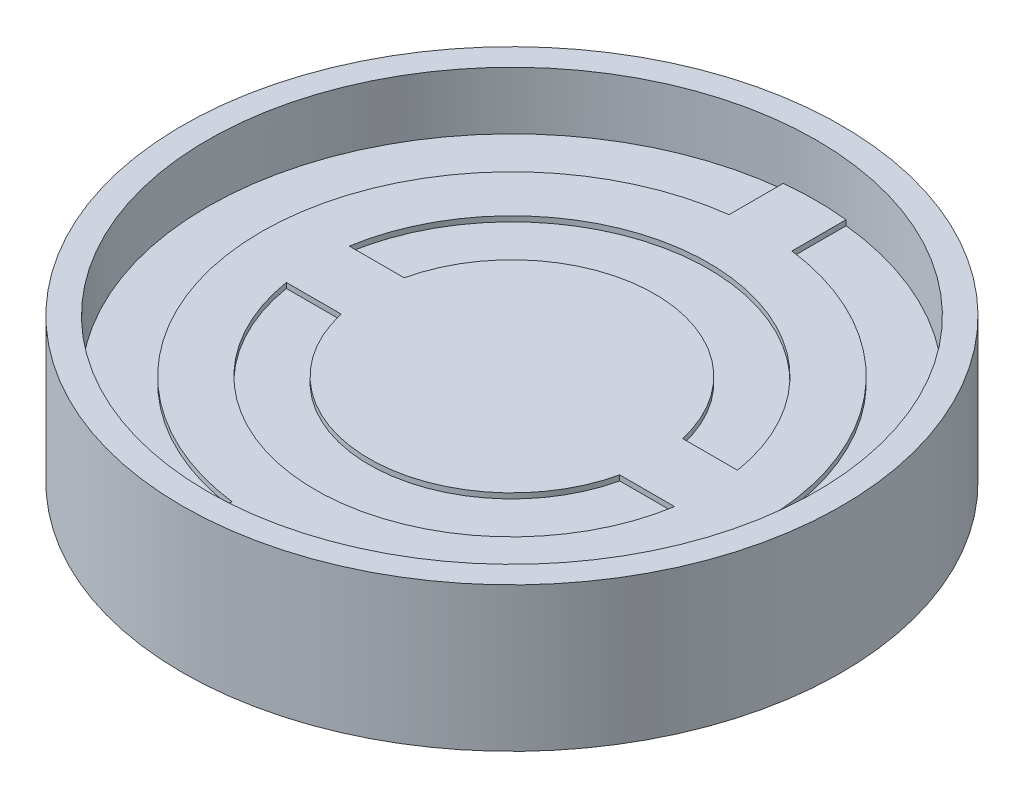
ISO-10303-21;
HEADER;
FILE_DESCRIPTION(('STEP AP214'),'2;1');
FILE_NAME('part.step','',(''),(''),'','','');
FILE_SCHEMA(('AUTOMOTIVE_DESIGN { 1 0 10303 214 1 1 1 1 }'));
ENDSEC;
DATA;
#1=APPLICATION_CONTEXT('core data for automotive mechanical design processes');
#2=APPLICATION_PROTOCOL_DEFINITION('international standard','automotive_design',2000,#1);
#3=PRODUCT_CONTEXT('',#1,'mechanical');
#4=PRODUCT('Part','Part','',(#3));
#5=PRODUCT_RELATED_PRODUCT_CATEGORY('part','',(#4));
#6=PRODUCT_DEFINITION_FORMATION('','',#4);
#7=PRODUCT_DEFINITION_CONTEXT('part definition',#1,'design');
#8=PRODUCT_DEFINITION('design','',#6,#7);
#9=PRODUCT_DEFINITION_SHAPE('','',#8);
#10=(LENGTH_UNIT() NAMED_UNIT(*) SI_UNIT(.MILLI.,.METRE.));
#11=(NAMED_UNIT(*) PLANE_ANGLE_UNIT() SI_UNIT($,.RADIAN.));
#12=(NAMED_UNIT(*) SI_UNIT($,.STERADIAN.) SOLID_ANGLE_UNIT());
#13=UNCERTAINTY_MEASURE_WITH_UNIT(LENGTH_MEASURE(1.E-05),#10,'distance_accuracy_value','');
#14=(GEOMETRIC_REPRESENTATION_CONTEXT(3) GLOBAL_UNCERTAINTY_ASSIGNED_CONTEXT((#13)) GLOBAL_UNIT_ASSIGNED_CONTEXT((#10,
#11,#12)) REPRESENTATION_CONTEXT('',''));
#15=CARTESIAN_POINT('',(0.,0.,0.));
#16=DIRECTION('',(0.,0.,1.));
#17=DIRECTION('',(1.,0.,0.));
#18=AXIS2_PLACEMENT_3D('',#15,#16,#17);
#19=CARTESIAN_POINT('',(0.,-0.6985,0.));
#20=DIRECTION('',(0.,-1.,0.));
#21=DIRECTION('',(0.,0.,1.));
#22=AXIS2_PLACEMENT_3D('',#19,#20,#21);
#23=PLANE('',#22);
#24=CARTESIAN_POINT('',(0.,-0.6985,0.));
#25=DIRECTION('',(0.,1.,0.));
#26=DIRECTION('',(0.,0.,1.));
#27=AXIS2_PLACEMENT_3D('',#24,#25,#26);
#28=CIRCLE('',#27,12.13485);
#29=CARTESIAN_POINT('',(1.524,-0.6985,12.0387710553237));
#30=VERTEX_POINT('',#29);
#31=CARTESIAN_POINT('',(1.524,-0.6985,-12.0387710553237));
#32=VERTEX_POINT('',#31);
#33=EDGE_CURVE('E324',#30,#32,#28,.T.);
#34=ORIENTED_EDGE('',*,*,#33,.T.);
#35=DIRECTION('',(0.,0.,1.));
#36=VECTOR('',#35,1.);
#37=CARTESIAN_POINT('',(1.524,-0.6985,0.));
#38=LINE('',#37,#36);
#39=CARTESIAN_POINT('',(1.524,-0.6985,-14.6657288291445));
#40=VERTEX_POINT('',#39);
#41=EDGE_CURVE('E321',#40,#32,#38,.T.);
#42=ORIENTED_EDGE('',*,*,#41,.F.);
#43=CARTESIAN_POINT('',(0.,-0.6985,0.));
#44=DIRECTION('',(0.,1.,0.));
#45=DIRECTION('',(0.,0.,1.));
#46=AXIS2_PLACEMENT_3D('',#43,#44,#45);
#47=CIRCLE('',#46,14.7447);
#48=CARTESIAN_POINT('',(1.524,-0.6985,14.6657288291445));
#49=VERTEX_POINT('',#48);
#50=EDGE_CURVE('E368',#49,#40,#47,.T.);
#51=ORIENTED_EDGE('',*,*,#50,.F.);
#52=DIRECTION('',(0.,0.,-1.));
#53=VECTOR('',#52,1.);
#54=CARTESIAN_POINT('',(1.524,-0.6985,0.));
#55=LINE('',#54,#53);
#56=EDGE_CURVE('E326',#49,#30,#55,.T.);
#57=ORIENTED_EDGE('',*,*,#56,.T.);
#58=EDGE_LOOP('',(#34,#42,#51,#57));
#59=FACE_BOUND('',#58,.T.);
#60=ADVANCED_FACE('F36',(#59),#23,.T.);
#61=CARTESIAN_POINT('',(0.,0.6985,0.));
#62=DIRECTION('',(0.,1.,0.));
#63=DIRECTION('',(0.,0.,1.));
#64=AXIS2_PLACEMENT_3D('',#61,#62,#63);
#65=CYLINDRICAL_SURFACE('',#64,14.7447);
#66=CARTESIAN_POINT('',(0.,3.4925,0.));
#67=DIRECTION('',(0.,1.,0.));
#68=DIRECTION('',(0.,0.,1.));
#69=AXIS2_PLACEMENT_3D('',#66,#67,#68);
#70=CIRCLE('',#69,14.7447);
#71=CARTESIAN_POINT('',(0.,3.4925,14.7447));
#72=VERTEX_POINT('',#71);
#73=EDGE_CURVE('E472',#72,#72,#70,.T.);
#74=ORIENTED_EDGE('',*,*,#73,.T.);
#75=EDGE_LOOP('',(#74));
#76=FACE_BOUND('',#75,.T.);
#77=DIRECTION('',(0.,-1.,0.));
#78=VECTOR('',#77,1.);
#79=CARTESIAN_POINT('',(-1.524,0.9525,-14.6657288291445));
#80=LINE('',#79,#78);
#81=CARTESIAN_POINT('',(-1.524,0.9525,-14.6657288291445));
#82=VERTEX_POINT('',#81);
#83=CARTESIAN_POINT('',(-1.524,0.6985,-14.6657288291445));
#84=VERTEX_POINT('',#83);
#85=EDGE_CURVE('E448',#82,#84,#80,.T.);
#86=ORIENTED_EDGE('',*,*,#85,.F.);
#87=CARTESIAN_POINT('',(0.,0.9525,0.));
#88=DIRECTION('',(0.,1.,0.));
#89=DIRECTION('',(0.,0.,1.));
#90=AXIS2_PLACEMENT_3D('',#87,#88,#89);
#91=CIRCLE('',#90,14.7447);
#92=CARTESIAN_POINT('',(1.524,0.9525,-14.6657288291445));
#93=VERTEX_POINT('',#92);
#94=EDGE_CURVE('E413',#93,#82,#91,.T.);
#95=ORIENTED_EDGE('',*,*,#94,.F.);
#96=DIRECTION('',(0.,-1.,0.));
#97=VECTOR('',#96,1.);
#98=CARTESIAN_POINT('',(1.524,0.9525,-14.6657288291445));
#99=LINE('',#98,#97);
#100=CARTESIAN_POINT('',(1.524,0.6985,-14.6657288291445));
#101=VERTEX_POINT('',#100);
#102=EDGE_CURVE('E451',#93,#101,#99,.T.);
#103=ORIENTED_EDGE('',*,*,#102,.T.);
#104=CARTESIAN_POINT('',(0.,0.6985,0.));
#105=DIRECTION('',(0.,1.,0.));
#106=DIRECTION('',(0.,0.,1.));
#107=AXIS2_PLACEMENT_3D('',#104,#105,#106);
#108=CIRCLE('',#107,14.7447);
#109=CARTESIAN_POINT('',(1.524,0.6985,14.6657288291445));
#110=VERTEX_POINT('',#109);
#111=EDGE_CURVE('E493',#110,#101,#108,.T.);
#112=ORIENTED_EDGE('',*,*,#111,.F.);
#113=DIRECTION('',(0.,-1.,0.));
#114=VECTOR('',#113,1.);
#115=CARTESIAN_POINT('',(1.524,0.9525,14.6657288291445));
#116=LINE('',#115,#114);
#117=CARTESIAN_POINT('',(1.524,0.9525,14.6657288291445));
#118=VERTEX_POINT('',#117);
#119=EDGE_CURVE('E461',#118,#110,#116,.T.);
#120=ORIENTED_EDGE('',*,*,#119,.F.);
#121=CARTESIAN_POINT('',(0.,0.9525,0.));
#122=DIRECTION('',(0.,1.,0.));
#123=DIRECTION('',(0.,0.,1.));
#124=AXIS2_PLACEMENT_3D('',#121,#122,#123);
#125=CIRCLE('',#124,14.7447);
#126=CARTESIAN_POINT('',(-1.524,0.9525,14.6657288291445));
#127=VERTEX_POINT('',#126);
#128=EDGE_CURVE('E405',#127,#118,#125,.T.);
#129=ORIENTED_EDGE('',*,*,#128,.F.);
#130=DIRECTION('',(0.,-1.,0.));
#131=VECTOR('',#130,1.);
#132=CARTESIAN_POINT('',(-1.524,0.9525,14.6657288291445));
#133=LINE('',#132,#131);
#134=CARTESIAN_POINT('',(-1.524,0.6985,14.6657288291445));
#135=VERTEX_POINT('',#134);
#136=EDGE_CURVE('E464',#127,#135,#133,.T.);
#137=ORIENTED_EDGE('',*,*,#136,.T.);
#138=EDGE_CURVE('E495',#84,#135,#108,.T.);
#139=ORIENTED_EDGE('',*,*,#138,.F.);
#140=EDGE_LOOP('',(#86,#95,#103,#112,#120,#129,#137,#139));
#141=FACE_BOUND('',#140,.T.);
#142=ADVANCED_FACE('F516',(#76,#141),#65,.F.);
#143=CARTESIAN_POINT('',(0.,0.6985,0.));
#144=DIRECTION('',(0.,1.,0.));
#145=DIRECTION('',(0.,0.,1.));
#146=AXIS2_PLACEMENT_3D('',#143,#144,#145);
#147=PLANE('',#146);
#148=CARTESIAN_POINT('',(0.,0.6985,0.));
#149=DIRECTION('',(0.,1.,0.));
#150=DIRECTION('',(0.,0.,1.));
#151=AXIS2_PLACEMENT_3D('',#148,#149,#150);
#152=CIRCLE('',#151,12.13485);
#153=CARTESIAN_POINT('',(-1.524,0.6985,-12.0387710553237));
#154=VERTEX_POINT('',#153);
#155=CARTESIAN_POINT('',(-1.524,0.6985,12.0387710553237));
#156=VERTEX_POINT('',#155);
#157=EDGE_CURVE('E438',#154,#156,#152,.T.);
#158=ORIENTED_EDGE('',*,*,#157,.F.);
#159=DIRECTION('',(0.,0.,1.));
#160=VECTOR('',#159,1.);
#161=CARTESIAN_POINT('',(-1.524,0.6985,0.));
#162=LINE('',#161,#160);
#163=EDGE_CURVE('E435',#84,#154,#162,.T.);
#164=ORIENTED_EDGE('',*,*,#163,.F.);
#165=ORIENTED_EDGE('',*,*,#138,.T.);
#166=DIRECTION('',(0.,0.,-1.));
#167=VECTOR('',#166,1.);
#168=CARTESIAN_POINT('',(-1.524,0.6985,0.));
#169=LINE('',#168,#167);
#170=EDGE_CURVE('E441',#135,#156,#169,.T.);
#171=ORIENTED_EDGE('',*,*,#170,.T.);
#172=EDGE_LOOP('',(#158,#164,#165,#171));
#173=FACE_BOUND('',#172,.T.);
#174=ADVANCED_FACE('F503',(#173),#147,.T.);
#175=CARTESIAN_POINT('',(1.524,0.6985,12.0387710553237));
#176=VERTEX_POINT('',#175);
#177=CARTESIAN_POINT('',(1.524,0.6985,-12.0387710553237));
#178=VERTEX_POINT('',#177);
#179=EDGE_CURVE('E442',#176,#178,#152,.T.);
#180=ORIENTED_EDGE('',*,*,#179,.F.);
#181=DIRECTION('',(0.,0.,-1.));
#182=VECTOR('',#181,1.);
#183=CARTESIAN_POINT('',(1.524,0.6985,0.));
#184=LINE('',#183,#182);
#185=EDGE_CURVE('E444',#110,#176,#184,.T.);
#186=ORIENTED_EDGE('',*,*,#185,.F.);
#187=ORIENTED_EDGE('',*,*,#111,.T.);
#188=DIRECTION('',(0.,0.,1.));
#189=VECTOR('',#188,1.);
#190=CARTESIAN_POINT('',(1.524,0.6985,0.));
#191=LINE('',#190,#189);
#192=EDGE_CURVE('E378',#101,#178,#191,.T.);
#193=ORIENTED_EDGE('',*,*,#192,.T.);
#194=EDGE_LOOP('',(#180,#186,#187,#193));
#195=FACE_BOUND('',#194,.T.);
#196=ADVANCED_FACE('F535',(#195),#147,.T.);
#197=CARTESIAN_POINT('',(0.,3.4925,0.));
#198=DIRECTION('',(0.,-1.,0.));
#199=DIRECTION('',(0.,0.,-1.));
#200=AXIS2_PLACEMENT_3D('',#197,#198,#199);
#201=CYLINDRICAL_SURFACE('',#200,15.9639);
#202=CARTESIAN_POINT('',(0.,3.4925,0.));
#203=DIRECTION('',(0.,1.,0.));
#204=DIRECTION('',(0.,0.,1.));
#205=AXIS2_PLACEMENT_3D('',#202,#203,#204);
#206=CIRCLE('',#205,15.9639);
#207=CARTESIAN_POINT('',(0.,3.4925,15.9639));
#208=VERTEX_POINT('',#207);
#209=EDGE_CURVE('E11',#208,#208,#206,.T.);
#210=ORIENTED_EDGE('',*,*,#209,.F.);
#211=EDGE_LOOP('',(#210));
#212=FACE_BOUND('',#211,.T.);
#213=CARTESIAN_POINT('',(0.,-3.4925,0.));
#214=DIRECTION('',(0.,1.,0.));
#215=DIRECTION('',(0.,0.,1.));
#216=AXIS2_PLACEMENT_3D('',#213,#214,#215);
#217=CIRCLE('',#216,15.9639);
#218=CARTESIAN_POINT('',(0.,-3.4925,15.9639));
#219=VERTEX_POINT('',#218);
#220=EDGE_CURVE('E40',#219,#219,#217,.T.);
#221=ORIENTED_EDGE('',*,*,#220,.T.);
#222=EDGE_LOOP('',(#221));
#223=FACE_BOUND('',#222,.T.);
#224=ADVANCED_FACE('F38',(#212,#223),#201,.T.);
#225=CARTESIAN_POINT('',(0.,3.4925,0.));
#226=DIRECTION('',(0.,1.,0.));
#227=DIRECTION('',(0.,0.,1.));
#228=AXIS2_PLACEMENT_3D('',#225,#226,#227);
#229=PLANE('',#228);
#230=ORIENTED_EDGE('',*,*,#73,.F.);
#231=EDGE_LOOP('',(#230));
#232=FACE_BOUND('',#231,.T.);
#233=ORIENTED_EDGE('',*,*,#209,.T.);
#234=EDGE_LOOP('',(#233));
#235=FACE_BOUND('',#234,.T.);
#236=ADVANCED_FACE('F543',(#232,#235),#229,.T.);
#237=CARTESIAN_POINT('',(0.,-3.4925,0.));
#238=DIRECTION('',(0.,1.,0.));
#239=DIRECTION('',(0.,0.,1.));
#240=AXIS2_PLACEMENT_3D('',#237,#238,#239);
#241=PLANE('',#240);
#242=CARTESIAN_POINT('',(0.,-3.4925,0.));
#243=DIRECTION('',(0.,1.,0.));
#244=DIRECTION('',(0.,0.,1.));
#245=AXIS2_PLACEMENT_3D('',#242,#243,#244);
#246=CIRCLE('',#245,14.7447);
#247=CARTESIAN_POINT('',(0.,-3.4925,14.7447));
#248=VERTEX_POINT('',#247);
#249=EDGE_CURVE('E352',#248,#248,#246,.T.);
#250=ORIENTED_EDGE('',*,*,#249,.T.);
#251=EDGE_LOOP('',(#250));
#252=FACE_BOUND('',#251,.T.);
#253=ORIENTED_EDGE('',*,*,#220,.F.);
#254=EDGE_LOOP('',(#253));
#255=FACE_BOUND('',#254,.T.);
#256=ADVANCED_FACE('F772',(#252,#255),#241,.F.);
#257=CARTESIAN_POINT('',(-1.524,0.9525,0.));
#258=DIRECTION('',(1.,0.,0.));
#259=DIRECTION('',(0.,0.,-1.));
#260=AXIS2_PLACEMENT_3D('',#257,#258,#259);
#261=PLANE('',#260);
#262=ORIENTED_EDGE('',*,*,#163,.T.);
#263=DIRECTION('',(0.,-1.,0.));
#264=VECTOR('',#263,1.);
#265=CARTESIAN_POINT('',(-1.524,0.9525,-12.0387710553237));
#266=LINE('',#265,#264);
#267=CARTESIAN_POINT('',(-1.524,0.9525,-12.0387710553237));
#268=VERTEX_POINT('',#267);
#269=EDGE_CURVE('E469',#268,#154,#266,.T.);
#270=ORIENTED_EDGE('',*,*,#269,.F.);
#271=DIRECTION('',(0.,0.,1.));
#272=VECTOR('',#271,1.);
#273=CARTESIAN_POINT('',(-1.524,0.9525,0.));
#274=LINE('',#273,#272);
#275=EDGE_CURVE('E396',#82,#268,#274,.T.);
#276=ORIENTED_EDGE('',*,*,#275,.F.);
#277=ORIENTED_EDGE('',*,*,#85,.T.);
#278=EDGE_LOOP('',(#262,#270,#276,#277));
#279=FACE_BOUND('',#278,.T.);
#280=ADVANCED_FACE('F515',(#279),#261,.F.);
#281=CARTESIAN_POINT('',(0.,0.9525,0.));
#282=DIRECTION('',(0.,-1.,0.));
#283=DIRECTION('',(0.,0.,-1.));
#284=AXIS2_PLACEMENT_3D('',#281,#282,#283);
#285=CYLINDRICAL_SURFACE('',#284,12.13485);
#286=ORIENTED_EDGE('',*,*,#157,.T.);
#287=DIRECTION('',(0.,-1.,0.));
#288=VECTOR('',#287,1.);
#289=CARTESIAN_POINT('',(-1.524,0.9525,12.0387710553237));
#290=LINE('',#289,#288);
#291=CARTESIAN_POINT('',(-1.524,0.9525,12.0387710553237));
#292=VERTEX_POINT('',#291);
#293=EDGE_CURVE('E466',#292,#156,#290,.T.);
#294=ORIENTED_EDGE('',*,*,#293,.F.);
#295=CARTESIAN_POINT('',(0.,0.9525,0.));
#296=DIRECTION('',(0.,1.,0.));
#297=DIRECTION('',(0.,0.,1.));
#298=AXIS2_PLACEMENT_3D('',#295,#296,#297);
#299=CIRCLE('',#298,12.13485);
#300=EDGE_CURVE('E399',#268,#292,#299,.T.);
#301=ORIENTED_EDGE('',*,*,#300,.F.);
#302=ORIENTED_EDGE('',*,*,#269,.T.);
#303=EDGE_LOOP('',(#286,#294,#301,#302));
#304=FACE_BOUND('',#303,.T.);
#305=ADVANCED_FACE('F511',(#304),#285,.T.);
#306=CARTESIAN_POINT('',(-1.524,0.9525,0.));
#307=DIRECTION('',(-1.,0.,0.));
#308=DIRECTION('',(0.,0.,1.));
#309=AXIS2_PLACEMENT_3D('',#306,#307,#308);
#310=PLANE('',#309);
#311=ORIENTED_EDGE('',*,*,#170,.F.);
#312=ORIENTED_EDGE('',*,*,#136,.F.);
#313=DIRECTION('',(0.,0.,-1.));
#314=VECTOR('',#313,1.);
#315=CARTESIAN_POINT('',(-1.524,0.9525,0.));
#316=LINE('',#315,#314);
#317=EDGE_CURVE('E401',#127,#292,#316,.T.);
#318=ORIENTED_EDGE('',*,*,#317,.T.);
#319=ORIENTED_EDGE('',*,*,#293,.T.);
#320=EDGE_LOOP('',(#311,#312,#318,#319));
#321=FACE_BOUND('',#320,.T.);
#322=ADVANCED_FACE('F507',(#321),#310,.T.);
#323=CARTESIAN_POINT('',(1.524,0.9525,0.));
#324=DIRECTION('',(-1.,0.,0.));
#325=DIRECTION('',(0.,0.,1.));
#326=AXIS2_PLACEMENT_3D('',#323,#324,#325);
#327=PLANE('',#326);
#328=ORIENTED_EDGE('',*,*,#185,.T.);
#329=DIRECTION('',(0.,-1.,0.));
#330=VECTOR('',#329,1.);
#331=CARTESIAN_POINT('',(1.524,0.9525,12.0387710553237));
#332=LINE('',#331,#330);
#333=CARTESIAN_POINT('',(1.524,0.9525,12.0387710553237));
#334=VERTEX_POINT('',#333);
#335=EDGE_CURVE('E458',#334,#176,#332,.T.);
#336=ORIENTED_EDGE('',*,*,#335,.F.);
#337=DIRECTION('',(0.,0.,-1.));
#338=VECTOR('',#337,1.);
#339=CARTESIAN_POINT('',(1.524,0.9525,0.));
#340=LINE('',#339,#338);
#341=EDGE_CURVE('E408',#118,#334,#340,.T.);
#342=ORIENTED_EDGE('',*,*,#341,.F.);
#343=ORIENTED_EDGE('',*,*,#119,.T.);
#344=EDGE_LOOP('',(#328,#336,#342,#343));
#345=FACE_BOUND('',#344,.T.);
#346=ADVANCED_FACE('F531',(#345),#327,.F.);
#347=ORIENTED_EDGE('',*,*,#179,.T.);
#348=DIRECTION('',(0.,-1.,0.));
#349=VECTOR('',#348,1.);
#350=CARTESIAN_POINT('',(1.524,0.9525,-12.0387710553237));
#351=LINE('',#350,#349);
#352=CARTESIAN_POINT('',(1.524,0.9525,-12.0387710553237));
#353=VERTEX_POINT('',#352);
#354=EDGE_CURVE('E455',#353,#178,#351,.T.);
#355=ORIENTED_EDGE('',*,*,#354,.F.);
#356=EDGE_CURVE('E402',#334,#353,#299,.T.);
#357=ORIENTED_EDGE('',*,*,#356,.F.);
#358=ORIENTED_EDGE('',*,*,#335,.T.);
#359=EDGE_LOOP('',(#347,#355,#357,#358));
#360=FACE_BOUND('',#359,.T.);
#361=ADVANCED_FACE('F534',(#360),#285,.T.);
#362=CARTESIAN_POINT('',(1.524,0.9525,0.));
#363=DIRECTION('',(1.,0.,0.));
#364=DIRECTION('',(0.,0.,-1.));
#365=AXIS2_PLACEMENT_3D('',#362,#363,#364);
#366=PLANE('',#365);
#367=ORIENTED_EDGE('',*,*,#192,.F.);
#368=ORIENTED_EDGE('',*,*,#102,.F.);
#369=DIRECTION('',(0.,0.,1.));
#370=VECTOR('',#369,1.);
#371=CARTESIAN_POINT('',(1.524,0.9525,0.));
#372=LINE('',#371,#370);
#373=EDGE_CURVE('E410',#93,#353,#372,.T.);
#374=ORIENTED_EDGE('',*,*,#373,.T.);
#375=ORIENTED_EDGE('',*,*,#354,.T.);
#376=EDGE_LOOP('',(#367,#368,#374,#375));
#377=FACE_BOUND('',#376,.T.);
#378=ADVANCED_FACE('F525',(#377),#366,.T.);
#379=CARTESIAN_POINT('',(0.,0.9525,0.));
#380=DIRECTION('',(0.,-1.,0.));
#381=DIRECTION('',(0.,0.,-1.));
#382=AXIS2_PLACEMENT_3D('',#379,#380,#381);
#383=CYLINDRICAL_SURFACE('',#382,9.525);
#384=CARTESIAN_POINT('',(0.,0.6985,0.));
#385=DIRECTION('',(0.,1.,0.));
#386=DIRECTION('',(0.,0.,1.));
#387=AXIS2_PLACEMENT_3D('',#384,#385,#386);
#388=CIRCLE('',#387,9.525);
#389=CARTESIAN_POINT('',(9.40228956159084,0.6985,-1.524));
#390=VERTEX_POINT('',#389);
#391=CARTESIAN_POINT('',(-9.40228956159084,0.6985,-1.524));
#392=VERTEX_POINT('',#391);
#393=EDGE_CURVE('E428',#390,#392,#388,.T.);
#394=ORIENTED_EDGE('',*,*,#393,.F.);
#395=DIRECTION('',(0.,-1.,0.));
#396=VECTOR('',#395,1.);
#397=CARTESIAN_POINT('',(9.40228956159084,0.9525,-1.524));
#398=LINE('',#397,#396);
#399=CARTESIAN_POINT('',(9.40228956159084,0.9525,-1.524));
#400=VERTEX_POINT('',#399);
#401=EDGE_CURVE('E452',#400,#390,#398,.T.);
#402=ORIENTED_EDGE('',*,*,#401,.F.);
#403=CARTESIAN_POINT('',(0.,0.9525,0.));
#404=DIRECTION('',(0.,1.,0.));
#405=DIRECTION('',(0.,0.,1.));
#406=AXIS2_PLACEMENT_3D('',#403,#404,#405);
#407=CIRCLE('',#406,9.525);
#408=CARTESIAN_POINT('',(-9.40228956159084,0.9525,-1.524));
#409=VERTEX_POINT('',#408);
#410=EDGE_CURVE('E387',#400,#409,#407,.T.);
#411=ORIENTED_EDGE('',*,*,#410,.T.);
#412=DIRECTION('',(0.,-1.,0.));
#413=VECTOR('',#412,1.);
#414=CARTESIAN_POINT('',(-9.40228956159084,0.9525,-1.524));
#415=LINE('',#414,#413);
#416=EDGE_CURVE('E473',#409,#392,#415,.T.);
#417=ORIENTED_EDGE('',*,*,#416,.T.);
#418=EDGE_LOOP('',(#394,#402,#411,#417));
#419=FACE_BOUND('',#418,.T.);
#420=ADVANCED_FACE('F818',(#419),#383,.F.);
#421=CARTESIAN_POINT('',(0.,0.9525,-1.524));
#422=DIRECTION('',(0.,0.,1.));
#423=DIRECTION('',(1.,0.,0.));
#424=AXIS2_PLACEMENT_3D('',#421,#422,#423);
#425=PLANE('',#424);
#426=DIRECTION('',(-1.,0.,0.));
#427=VECTOR('',#426,1.);
#428=CARTESIAN_POINT('',(0.,0.6985,-1.524));
#429=LINE('',#428,#427);
#430=CARTESIAN_POINT('',(6.7451259085728,0.6985,-1.524));
#431=VERTEX_POINT('',#430);
#432=EDGE_CURVE('E430',#390,#431,#429,.T.);
#433=ORIENTED_EDGE('',*,*,#432,.T.);
#434=DIRECTION('',(0.,-1.,0.));
#435=VECTOR('',#434,1.);
#436=CARTESIAN_POINT('',(6.7451259085728,0.9525,-1.524));
#437=LINE('',#436,#435);
#438=CARTESIAN_POINT('',(6.7451259085728,0.9525,-1.524));
#439=VERTEX_POINT('',#438);
#440=EDGE_CURVE('E480',#439,#431,#437,.T.);
#441=ORIENTED_EDGE('',*,*,#440,.F.);
#442=DIRECTION('',(-1.,0.,0.));
#443=VECTOR('',#442,1.);
#444=CARTESIAN_POINT('',(0.,0.9525,-1.524));
#445=LINE('',#444,#443);
#446=EDGE_CURVE('E390',#400,#439,#445,.T.);
#447=ORIENTED_EDGE('',*,*,#446,.F.);
#448=ORIENTED_EDGE('',*,*,#401,.T.);
#449=EDGE_LOOP('',(#433,#441,#447,#448));
#450=FACE_BOUND('',#449,.T.);
#451=ADVANCED_FACE('F825',(#450),#425,.F.);
#452=CARTESIAN_POINT('',(0.,0.9525,0.));
#453=DIRECTION('',(0.,-1.,0.));
#454=DIRECTION('',(0.,0.,-1.));
#455=AXIS2_PLACEMENT_3D('',#452,#453,#454);
#456=CYLINDRICAL_SURFACE('',#455,6.91515);
#457=CARTESIAN_POINT('',(0.,0.6985,0.));
#458=DIRECTION('',(0.,1.,0.));
#459=DIRECTION('',(0.,0.,1.));
#460=AXIS2_PLACEMENT_3D('',#457,#458,#459);
#461=CIRCLE('',#460,6.91515);
#462=CARTESIAN_POINT('',(-6.7451259085728,0.6985,-1.524));
#463=VERTEX_POINT('',#462);
#464=EDGE_CURVE('E420',#431,#463,#461,.T.);
#465=ORIENTED_EDGE('',*,*,#464,.T.);
#466=DIRECTION('',(0.,-1.,0.));
#467=VECTOR('',#466,1.);
#468=CARTESIAN_POINT('',(-6.7451259085728,0.9525,-1.524));
#469=LINE('',#468,#467);
#470=CARTESIAN_POINT('',(-6.7451259085728,0.9525,-1.524));
#471=VERTEX_POINT('',#470);
#472=EDGE_CURVE('E476',#471,#463,#469,.T.);
#473=ORIENTED_EDGE('',*,*,#472,.F.);
#474=CARTESIAN_POINT('',(0.,0.9525,0.));
#475=DIRECTION('',(0.,1.,0.));
#476=DIRECTION('',(0.,0.,1.));
#477=AXIS2_PLACEMENT_3D('',#474,#475,#476);
#478=CIRCLE('',#477,6.91515);
#479=EDGE_CURVE('E379',#439,#471,#478,.T.);
#480=ORIENTED_EDGE('',*,*,#479,.F.);
#481=ORIENTED_EDGE('',*,*,#440,.T.);
#482=EDGE_LOOP('',(#465,#473,#480,#481));
#483=FACE_BOUND('',#482,.T.);
#484=ADVANCED_FACE('F833',(#483),#456,.T.);
#485=CARTESIAN_POINT('',(-6.7451259085728,0.6985,1.524));
#486=VERTEX_POINT('',#485);
#487=CARTESIAN_POINT('',(6.7451259085728,0.6985,1.524));
#488=VERTEX_POINT('',#487);
#489=EDGE_CURVE('E371',#486,#488,#461,.T.);
#490=ORIENTED_EDGE('',*,*,#489,.T.);
#491=DIRECTION('',(0.,-1.,0.));
#492=VECTOR('',#491,1.);
#493=CARTESIAN_POINT('',(6.7451259085728,0.9525,1.524));
#494=LINE('',#493,#492);
#495=CARTESIAN_POINT('',(6.7451259085728,0.9525,1.524));
#496=VERTEX_POINT('',#495);
#497=EDGE_CURVE('E477',#496,#488,#494,.T.);
#498=ORIENTED_EDGE('',*,*,#497,.F.);
#499=CARTESIAN_POINT('',(-6.7451259085728,0.9525,1.524));
#500=VERTEX_POINT('',#499);
#501=EDGE_CURVE('E375',#500,#496,#478,.T.);
#502=ORIENTED_EDGE('',*,*,#501,.F.);
#503=DIRECTION('',(0.,-1.,0.));
#504=VECTOR('',#503,1.);
#505=CARTESIAN_POINT('',(-6.7451259085728,0.9525,1.524));
#506=LINE('',#505,#504);
#507=EDGE_CURVE('E416',#500,#486,#506,.T.);
#508=ORIENTED_EDGE('',*,*,#507,.T.);
#509=EDGE_LOOP('',(#490,#498,#502,#508));
#510=FACE_BOUND('',#509,.T.);
#511=ADVANCED_FACE('F841',(#510),#456,.T.);
#512=CARTESIAN_POINT('',(0.,0.9525,1.524));
#513=DIRECTION('',(0.,0.,1.));
#514=DIRECTION('',(1.,0.,0.));
#515=AXIS2_PLACEMENT_3D('',#512,#513,#514);
#516=PLANE('',#515);
#517=DIRECTION('',(-1.,0.,0.));
#518=VECTOR('',#517,1.);
#519=CARTESIAN_POINT('',(0.,0.6985,1.524));
#520=LINE('',#519,#518);
#521=CARTESIAN_POINT('',(9.40228956159084,0.6985,1.524));
#522=VERTEX_POINT('',#521);
#523=EDGE_CURVE('E419',#522,#488,#520,.T.);
#524=ORIENTED_EDGE('',*,*,#523,.F.);
#525=DIRECTION('',(0.,-1.,0.));
#526=VECTOR('',#525,1.);
#527=CARTESIAN_POINT('',(9.40228956159084,0.9525,1.524));
#528=LINE('',#527,#526);
#529=CARTESIAN_POINT('',(9.40228956159084,0.9525,1.524));
#530=VERTEX_POINT('',#529);
#531=EDGE_CURVE('E490',#530,#522,#528,.T.);
#532=ORIENTED_EDGE('',*,*,#531,.F.);
#533=DIRECTION('',(-1.,0.,0.));
#534=VECTOR('',#533,1.);
#535=CARTESIAN_POINT('',(0.,0.9525,1.524));
#536=LINE('',#535,#534);
#537=EDGE_CURVE('E377',#530,#496,#536,.T.);
#538=ORIENTED_EDGE('',*,*,#537,.T.);
#539=ORIENTED_EDGE('',*,*,#497,.T.);
#540=EDGE_LOOP('',(#524,#532,#538,#539));
#541=FACE_BOUND('',#540,.T.);
#542=ADVANCED_FACE('F849',(#541),#516,.T.);
#543=CARTESIAN_POINT('',(0.,0.9525,0.));
#544=DIRECTION('',(0.,-1.,0.));
#545=DIRECTION('',(0.,0.,-1.));
#546=AXIS2_PLACEMENT_3D('',#543,#544,#545);
#547=CYLINDRICAL_SURFACE('',#546,9.525);
#548=CARTESIAN_POINT('',(0.,0.6985,0.));
#549=DIRECTION('',(0.,1.,0.));
#550=DIRECTION('',(0.,0.,1.));
#551=AXIS2_PLACEMENT_3D('',#548,#549,#550);
#552=CIRCLE('',#551,9.525);
#553=CARTESIAN_POINT('',(-9.40228956159084,0.6985,1.524));
#554=VERTEX_POINT('',#553);
#555=EDGE_CURVE('E423',#554,#522,#552,.T.);
#556=ORIENTED_EDGE('',*,*,#555,.F.);
#557=DIRECTION('',(0.,-1.,0.));
#558=VECTOR('',#557,1.);
#559=CARTESIAN_POINT('',(-9.40228956159084,0.9525,1.524));
#560=LINE('',#559,#558);
#561=CARTESIAN_POINT('',(-9.40228956159084,0.9525,1.524));
#562=VERTEX_POINT('',#561);
#563=EDGE_CURVE('E487',#562,#554,#560,.T.);
#564=ORIENTED_EDGE('',*,*,#563,.F.);
#565=CARTESIAN_POINT('',(0.,0.9525,0.));
#566=DIRECTION('',(0.,1.,0.));
#567=DIRECTION('',(0.,0.,1.));
#568=AXIS2_PLACEMENT_3D('',#565,#566,#567);
#569=CIRCLE('',#568,9.525);
#570=EDGE_CURVE('E382',#562,#530,#569,.T.);
#571=ORIENTED_EDGE('',*,*,#570,.T.);
#572=ORIENTED_EDGE('',*,*,#531,.T.);
#573=EDGE_LOOP('',(#556,#564,#571,#572));
#574=FACE_BOUND('',#573,.T.);
#575=ADVANCED_FACE('F856',(#574),#547,.F.);
#576=CARTESIAN_POINT('',(0.,0.9525,-1.524));
#577=DIRECTION('',(0.,0.,-1.));
#578=DIRECTION('',(-1.,0.,0.));
#579=AXIS2_PLACEMENT_3D('',#576,#577,#578);
#580=PLANE('',#579);
#581=DIRECTION('',(1.,0.,0.));
#582=VECTOR('',#581,1.);
#583=CARTESIAN_POINT('',(0.,0.6985,-1.524));
#584=LINE('',#583,#582);
#585=EDGE_CURVE('E433',#392,#463,#584,.T.);
#586=ORIENTED_EDGE('',*,*,#585,.F.);
#587=ORIENTED_EDGE('',*,*,#416,.F.);
#588=DIRECTION('',(1.,0.,0.));
#589=VECTOR('',#588,1.);
#590=CARTESIAN_POINT('',(0.,0.9525,-1.524));
#591=LINE('',#590,#589);
#592=EDGE_CURVE('E393',#409,#471,#591,.T.);
#593=ORIENTED_EDGE('',*,*,#592,.T.);
#594=ORIENTED_EDGE('',*,*,#472,.T.);
#595=EDGE_LOOP('',(#586,#587,#593,#594));
#596=FACE_BOUND('',#595,.T.);
#597=ADVANCED_FACE('F863',(#596),#580,.T.);
#598=CARTESIAN_POINT('',(0.,0.9525,1.524));
#599=DIRECTION('',(0.,0.,-1.));
#600=DIRECTION('',(-1.,0.,0.));
#601=AXIS2_PLACEMENT_3D('',#598,#599,#600);
#602=PLANE('',#601);
#603=DIRECTION('',(1.,0.,0.));
#604=VECTOR('',#603,1.);
#605=CARTESIAN_POINT('',(0.,0.6985,1.524));
#606=LINE('',#605,#604);
#607=EDGE_CURVE('E426',#554,#486,#606,.T.);
#608=ORIENTED_EDGE('',*,*,#607,.T.);
#609=ORIENTED_EDGE('',*,*,#507,.F.);
#610=DIRECTION('',(1.,0.,0.));
#611=VECTOR('',#610,1.);
#612=CARTESIAN_POINT('',(0.,0.9525,1.524));
#613=LINE('',#612,#611);
#614=EDGE_CURVE('E385',#562,#500,#613,.T.);
#615=ORIENTED_EDGE('',*,*,#614,.F.);
#616=ORIENTED_EDGE('',*,*,#563,.T.);
#617=EDGE_LOOP('',(#608,#609,#615,#616));
#618=FACE_BOUND('',#617,.T.);
#619=ADVANCED_FACE('F871',(#618),#602,.F.);
#620=CARTESIAN_POINT('',(0.,0.9525,0.));
#621=DIRECTION('',(0.,1.,0.));
#622=DIRECTION('',(0.,0.,1.));
#623=AXIS2_PLACEMENT_3D('',#620,#621,#622);
#624=PLANE('',#623);
#625=ORIENTED_EDGE('',*,*,#501,.T.);
#626=ORIENTED_EDGE('',*,*,#537,.F.);
#627=ORIENTED_EDGE('',*,*,#570,.F.);
#628=ORIENTED_EDGE('',*,*,#614,.T.);
#629=EDGE_LOOP('',(#625,#626,#627,#628));
#630=FACE_BOUND('',#629,.T.);
#631=ORIENTED_EDGE('',*,*,#410,.F.);
#632=ORIENTED_EDGE('',*,*,#446,.T.);
#633=ORIENTED_EDGE('',*,*,#479,.T.);
#634=ORIENTED_EDGE('',*,*,#592,.F.);
#635=EDGE_LOOP('',(#631,#632,#633,#634));
#636=FACE_BOUND('',#635,.T.);
#637=ORIENTED_EDGE('',*,*,#275,.T.);
#638=ORIENTED_EDGE('',*,*,#300,.T.);
#639=ORIENTED_EDGE('',*,*,#317,.F.);
#640=ORIENTED_EDGE('',*,*,#128,.T.);
#641=ORIENTED_EDGE('',*,*,#341,.T.);
#642=ORIENTED_EDGE('',*,*,#356,.T.);
#643=ORIENTED_EDGE('',*,*,#373,.F.);
#644=ORIENTED_EDGE('',*,*,#94,.T.);
#645=EDGE_LOOP('',(#637,#638,#639,#640,#641,#642,#643,#644));
#646=FACE_BOUND('',#645,.T.);
#647=ADVANCED_FACE('F520',(#630,#636,#646),#624,.T.);
#648=ORIENTED_EDGE('',*,*,#393,.T.);
#649=ORIENTED_EDGE('',*,*,#585,.T.);
#650=ORIENTED_EDGE('',*,*,#464,.F.);
#651=ORIENTED_EDGE('',*,*,#432,.F.);
#652=EDGE_LOOP('',(#648,#649,#650,#651));
#653=FACE_BOUND('',#652,.T.);
#654=ADVANCED_FACE('F545',(#653),#147,.T.);
#655=ORIENTED_EDGE('',*,*,#523,.T.);
#656=ORIENTED_EDGE('',*,*,#489,.F.);
#657=ORIENTED_EDGE('',*,*,#607,.F.);
#658=ORIENTED_EDGE('',*,*,#555,.T.);
#659=EDGE_LOOP('',(#655,#656,#657,#658));
#660=FACE_BOUND('',#659,.T.);
#661=ADVANCED_FACE('F538',(#660),#147,.T.);
#662=CARTESIAN_POINT('',(0.,-0.6985,0.));
#663=DIRECTION('',(0.,-1.,0.));
#664=DIRECTION('',(0.,0.,-1.));
#665=AXIS2_PLACEMENT_3D('',#662,#663,#664);
#666=CYLINDRICAL_SURFACE('',#665,14.7447);
#667=DIRECTION('',(0.,1.,0.));
#668=VECTOR('',#667,1.);
#669=CARTESIAN_POINT('',(1.524,-0.9525,14.6657288291445));
#670=LINE('',#669,#668);
#671=CARTESIAN_POINT('',(1.524,-0.9525,14.6657288291445));
#672=VERTEX_POINT('',#671);
#673=EDGE_CURVE('E339',#672,#49,#670,.T.);
#674=ORIENTED_EDGE('',*,*,#673,.T.);
#675=ORIENTED_EDGE('',*,*,#50,.T.);
#676=DIRECTION('',(0.,1.,0.));
#677=VECTOR('',#676,1.);
#678=CARTESIAN_POINT('',(1.524,-0.9525,-14.6657288291445));
#679=LINE('',#678,#677);
#680=CARTESIAN_POINT('',(1.524,-0.9525,-14.6657288291445));
#681=VERTEX_POINT('',#680);
#682=EDGE_CURVE('E347',#681,#40,#679,.T.);
#683=ORIENTED_EDGE('',*,*,#682,.F.);
#684=CARTESIAN_POINT('',(0.,-0.9525,0.));
#685=DIRECTION('',(0.,1.,0.));
#686=DIRECTION('',(0.,0.,1.));
#687=AXIS2_PLACEMENT_3D('',#684,#685,#686);
#688=CIRCLE('',#687,14.7447);
#689=CARTESIAN_POINT('',(-1.524,-0.9525,-14.6657288291445));
#690=VERTEX_POINT('',#689);
#691=EDGE_CURVE('E287',#681,#690,#688,.T.);
#692=ORIENTED_EDGE('',*,*,#691,.T.);
#693=DIRECTION('',(0.,1.,0.));
#694=VECTOR('',#693,1.);
#695=CARTESIAN_POINT('',(-1.524,-0.9525,-14.6657288291445));
#696=LINE('',#695,#694);
#697=CARTESIAN_POINT('',(-1.524,-0.6985,-14.6657288291445));
#698=VERTEX_POINT('',#697);
#699=EDGE_CURVE('E350',#690,#698,#696,.T.);
#700=ORIENTED_EDGE('',*,*,#699,.T.);
#701=CARTESIAN_POINT('',(-1.524,-0.6985,14.6657288291445));
#702=VERTEX_POINT('',#701);
#703=EDGE_CURVE('E372',#698,#702,#47,.T.);
#704=ORIENTED_EDGE('',*,*,#703,.T.);
#705=DIRECTION('',(0.,1.,0.));
#706=VECTOR('',#705,1.);
#707=CARTESIAN_POINT('',(-1.524,-0.9525,14.6657288291445));
#708=LINE('',#707,#706);
#709=CARTESIAN_POINT('',(-1.524,-0.9525,14.6657288291445));
#710=VERTEX_POINT('',#709);
#711=EDGE_CURVE('E51',#710,#702,#708,.T.);
#712=ORIENTED_EDGE('',*,*,#711,.F.);
#713=CARTESIAN_POINT('',(0.,-0.9525,0.));
#714=DIRECTION('',(0.,1.,0.));
#715=DIRECTION('',(0.,0.,1.));
#716=AXIS2_PLACEMENT_3D('',#713,#714,#715);
#717=CIRCLE('',#716,14.7447);
#718=EDGE_CURVE('E56',#710,#672,#717,.T.);
#719=ORIENTED_EDGE('',*,*,#718,.T.);
#720=EDGE_LOOP('',(#674,#675,#683,#692,#700,#704,#712,#719));
#721=FACE_BOUND('',#720,.T.);
#722=ORIENTED_EDGE('',*,*,#249,.F.);
#723=EDGE_LOOP('',(#722));
#724=FACE_BOUND('',#723,.T.);
#725=ADVANCED_FACE('F549',(#721,#724),#666,.F.);
#726=DIRECTION('',(0.,0.,1.));
#727=VECTOR('',#726,1.);
#728=CARTESIAN_POINT('',(-1.524,-0.6985,0.));
#729=LINE('',#728,#727);
#730=CARTESIAN_POINT('',(-1.524,-0.6985,-12.0387710553237));
#731=VERTEX_POINT('',#730);
#732=EDGE_CURVE('E319',#698,#731,#729,.T.);
#733=ORIENTED_EDGE('',*,*,#732,.T.);
#734=CARTESIAN_POINT('',(-1.524,-0.6985,12.0387710553237));
#735=VERTEX_POINT('',#734);
#736=EDGE_CURVE('E266',#731,#735,#28,.T.);
#737=ORIENTED_EDGE('',*,*,#736,.T.);
#738=DIRECTION('',(0.,0.,-1.));
#739=VECTOR('',#738,1.);
#740=CARTESIAN_POINT('',(-1.524,-0.6985,0.));
#741=LINE('',#740,#739);
#742=EDGE_CURVE('E328',#702,#735,#741,.T.);
#743=ORIENTED_EDGE('',*,*,#742,.F.);
#744=ORIENTED_EDGE('',*,*,#703,.F.);
#745=EDGE_LOOP('',(#733,#737,#743,#744));
#746=FACE_BOUND('',#745,.T.);
#747=ADVANCED_FACE('F555',(#746),#23,.T.);
#748=CARTESIAN_POINT('',(-1.524,-0.9525,0.));
#749=DIRECTION('',(-1.,0.,0.));
#750=DIRECTION('',(0.,0.,1.));
#751=AXIS2_PLACEMENT_3D('',#748,#749,#750);
#752=PLANE('',#751);
#753=ORIENTED_EDGE('',*,*,#732,.F.);
#754=ORIENTED_EDGE('',*,*,#699,.F.);
#755=DIRECTION('',(0.,0.,1.));
#756=VECTOR('',#755,1.);
#757=CARTESIAN_POINT('',(-1.524,-0.9525,0.));
#758=LINE('',#757,#756);
#759=CARTESIAN_POINT('',(-1.524,-0.9525,-12.0387710553237));
#760=VERTEX_POINT('',#759);
#761=EDGE_CURVE('E284',#690,#760,#758,.T.);
#762=ORIENTED_EDGE('',*,*,#761,.T.);
#763=DIRECTION('',(0.,1.,0.));
#764=VECTOR('',#763,1.);
#765=CARTESIAN_POINT('',(-1.524,-0.9525,-12.0387710553237));
#766=LINE('',#765,#764);
#767=EDGE_CURVE('E331',#760,#731,#766,.T.);
#768=ORIENTED_EDGE('',*,*,#767,.T.);
#769=EDGE_LOOP('',(#753,#754,#762,#768));
#770=FACE_BOUND('',#769,.T.);
#771=ADVANCED_FACE('F565',(#770),#752,.T.);
#772=CARTESIAN_POINT('',(1.524,-0.9525,0.));
#773=DIRECTION('',(-1.,0.,0.));
#774=DIRECTION('',(0.,0.,1.));
#775=AXIS2_PLACEMENT_3D('',#772,#773,#774);
#776=PLANE('',#775);
#777=ORIENTED_EDGE('',*,*,#41,.T.);
#778=DIRECTION('',(0.,1.,0.));
#779=VECTOR('',#778,1.);
#780=CARTESIAN_POINT('',(1.524,-0.9525,-12.0387710553237));
#781=LINE('',#780,#779);
#782=CARTESIAN_POINT('',(1.524,-0.9525,-12.0387710553237));
#783=VERTEX_POINT('',#782);
#784=EDGE_CURVE('E344',#783,#32,#781,.T.);
#785=ORIENTED_EDGE('',*,*,#784,.F.);
#786=DIRECTION('',(0.,0.,1.));
#787=VECTOR('',#786,1.);
#788=CARTESIAN_POINT('',(1.524,-0.9525,0.));
#789=LINE('',#788,#787);
#790=EDGE_CURVE('E289',#681,#783,#789,.T.);
#791=ORIENTED_EDGE('',*,*,#790,.F.);
#792=ORIENTED_EDGE('',*,*,#682,.T.);
#793=EDGE_LOOP('',(#777,#785,#791,#792));
#794=FACE_BOUND('',#793,.T.);
#795=ADVANCED_FACE('F571',(#794),#776,.F.);
#796=CARTESIAN_POINT('',(0.,-0.9525,0.));
#797=DIRECTION('',(0.,1.,0.));
#798=DIRECTION('',(0.,0.,1.));
#799=AXIS2_PLACEMENT_3D('',#796,#797,#798);
#800=CYLINDRICAL_SURFACE('',#799,12.13485);
#801=ORIENTED_EDGE('',*,*,#33,.F.);
#802=DIRECTION('',(0.,1.,0.));
#803=VECTOR('',#802,1.);
#804=CARTESIAN_POINT('',(1.524,-0.9525,12.0387710553237));
#805=LINE('',#804,#803);
#806=CARTESIAN_POINT('',(1.524,-0.9525,12.0387710553237));
#807=VERTEX_POINT('',#806);
#808=EDGE_CURVE('E341',#807,#30,#805,.T.);
#809=ORIENTED_EDGE('',*,*,#808,.F.);
#810=CARTESIAN_POINT('',(0.,-0.9525,0.));
#811=DIRECTION('',(0.,1.,0.));
#812=DIRECTION('',(0.,0.,1.));
#813=AXIS2_PLACEMENT_3D('',#810,#811,#812);
#814=CIRCLE('',#813,12.13485);
#815=EDGE_CURVE('E291',#807,#783,#814,.T.);
#816=ORIENTED_EDGE('',*,*,#815,.T.);
#817=ORIENTED_EDGE('',*,*,#784,.T.);
#818=EDGE_LOOP('',(#801,#809,#816,#817));
#819=FACE_BOUND('',#818,.T.);
#820=ADVANCED_FACE('F597',(#819),#800,.T.);
#821=CARTESIAN_POINT('',(1.524,-0.9525,0.));
#822=DIRECTION('',(1.,0.,0.));
#823=DIRECTION('',(0.,0.,-1.));
#824=AXIS2_PLACEMENT_3D('',#821,#822,#823);
#825=PLANE('',#824);
#826=ORIENTED_EDGE('',*,*,#56,.F.);
#827=ORIENTED_EDGE('',*,*,#673,.F.);
#828=DIRECTION('',(0.,0.,-1.));
#829=VECTOR('',#828,1.);
#830=CARTESIAN_POINT('',(1.524,-0.9525,0.));
#831=LINE('',#830,#829);
#832=EDGE_CURVE('E294',#672,#807,#831,.T.);
#833=ORIENTED_EDGE('',*,*,#832,.T.);
#834=ORIENTED_EDGE('',*,*,#808,.T.);
#835=EDGE_LOOP('',(#826,#827,#833,#834));
#836=FACE_BOUND('',#835,.T.);
#837=ADVANCED_FACE('F647',(#836),#825,.T.);
#838=CARTESIAN_POINT('',(-1.524,-0.9525,0.));
#839=DIRECTION('',(1.,0.,0.));
#840=DIRECTION('',(0.,0.,-1.));
#841=AXIS2_PLACEMENT_3D('',#838,#839,#840);
#842=PLANE('',#841);
#843=ORIENTED_EDGE('',*,*,#742,.T.);
#844=DIRECTION('',(0.,1.,0.));
#845=VECTOR('',#844,1.);
#846=CARTESIAN_POINT('',(-1.524,-0.9525,12.0387710553237));
#847=LINE('',#846,#845);
#848=CARTESIAN_POINT('',(-1.524,-0.9525,12.0387710553237));
#849=VERTEX_POINT('',#848);
#850=EDGE_CURVE('E334',#849,#735,#847,.T.);
#851=ORIENTED_EDGE('',*,*,#850,.F.);
#852=DIRECTION('',(0.,0.,-1.));
#853=VECTOR('',#852,1.);
#854=CARTESIAN_POINT('',(-1.524,-0.9525,0.));
#855=LINE('',#854,#853);
#856=EDGE_CURVE('E299',#710,#849,#855,.T.);
#857=ORIENTED_EDGE('',*,*,#856,.F.);
#858=ORIENTED_EDGE('',*,*,#711,.T.);
#859=EDGE_LOOP('',(#843,#851,#857,#858));
#860=FACE_BOUND('',#859,.T.);
#861=ADVANCED_FACE('F621',(#860),#842,.F.);
#862=CARTESIAN_POINT('',(0.,-0.9525,0.));
#863=DIRECTION('',(0.,1.,0.));
#864=DIRECTION('',(0.,0.,1.));
#865=AXIS2_PLACEMENT_3D('',#862,#863,#864);
#866=CYLINDRICAL_SURFACE('',#865,9.525);
#867=CARTESIAN_POINT('',(0.,-0.6985,0.));
#868=DIRECTION('',(0.,1.,0.));
#869=DIRECTION('',(0.,0.,1.));
#870=AXIS2_PLACEMENT_3D('',#867,#868,#869);
#871=CIRCLE('',#870,9.525);
#872=CARTESIAN_POINT('',(9.40228956159084,-0.6985,-1.524));
#873=VERTEX_POINT('',#872);
#874=CARTESIAN_POINT('',(-9.40228956159084,-0.6985,-1.524));
#875=VERTEX_POINT('',#874);
#876=EDGE_CURVE('E311',#873,#875,#871,.T.);
#877=ORIENTED_EDGE('',*,*,#876,.T.);
#878=DIRECTION('',(0.,1.,0.));
#879=VECTOR('',#878,1.);
#880=CARTESIAN_POINT('',(-9.40228956159084,-0.9525,-1.524));
#881=LINE('',#880,#879);
#882=CARTESIAN_POINT('',(-9.40228956159084,-0.9525,-1.524));
#883=VERTEX_POINT('',#882);
#884=EDGE_CURVE('E335',#883,#875,#881,.T.);
#885=ORIENTED_EDGE('',*,*,#884,.F.);
#886=CARTESIAN_POINT('',(0.,-0.9525,0.));
#887=DIRECTION('',(0.,1.,0.));
#888=DIRECTION('',(0.,0.,1.));
#889=AXIS2_PLACEMENT_3D('',#886,#887,#888);
#890=CIRCLE('',#889,9.525);
#891=CARTESIAN_POINT('',(9.40228956159084,-0.9525,-1.524));
#892=VERTEX_POINT('',#891);
#893=EDGE_CURVE('E276',#892,#883,#890,.T.);
#894=ORIENTED_EDGE('',*,*,#893,.F.);
#895=DIRECTION('',(0.,1.,0.));
#896=VECTOR('',#895,1.);
#897=CARTESIAN_POINT('',(9.40228956159084,-0.9525,-1.524));
#898=LINE('',#897,#896);
#899=EDGE_CURVE('E255',#892,#873,#898,.T.);
#900=ORIENTED_EDGE('',*,*,#899,.T.);
#901=EDGE_LOOP('',(#877,#885,#894,#900));
#902=FACE_BOUND('',#901,.T.);
#903=ADVANCED_FACE('F602',(#902),#866,.F.);
#904=CARTESIAN_POINT('',(0.,-0.9525,-1.524));
#905=DIRECTION('',(0.,0.,1.));
#906=DIRECTION('',(1.,0.,0.));
#907=AXIS2_PLACEMENT_3D('',#904,#905,#906);
#908=PLANE('',#907);
#909=DIRECTION('',(1.,0.,0.));
#910=VECTOR('',#909,1.);
#911=CARTESIAN_POINT('',(0.,-0.6985,-1.524));
#912=LINE('',#911,#910);
#913=CARTESIAN_POINT('',(-6.7451259085728,-0.6985,-1.524));
#914=VERTEX_POINT('',#913);
#915=EDGE_CURVE('E314',#875,#914,#912,.T.);
#916=ORIENTED_EDGE('',*,*,#915,.T.);
#917=DIRECTION('',(0.,1.,0.));
#918=VECTOR('',#917,1.);
#919=CARTESIAN_POINT('',(-6.7451259085728,-0.9525,-1.524));
#920=LINE('',#919,#918);
#921=CARTESIAN_POINT('',(-6.7451259085728,-0.9525,-1.524));
#922=VERTEX_POINT('',#921);
#923=EDGE_CURVE('E358',#922,#914,#920,.T.);
#924=ORIENTED_EDGE('',*,*,#923,.F.);
#925=DIRECTION('',(1.,0.,0.));
#926=VECTOR('',#925,1.);
#927=CARTESIAN_POINT('',(0.,-0.9525,-1.524));
#928=LINE('',#927,#926);
#929=EDGE_CURVE('E279',#883,#922,#928,.T.);
#930=ORIENTED_EDGE('',*,*,#929,.F.);
#931=ORIENTED_EDGE('',*,*,#884,.T.);
#932=EDGE_LOOP('',(#916,#924,#930,#931));
#933=FACE_BOUND('',#932,.T.);
#934=ADVANCED_FACE('F614',(#933),#908,.F.);
#935=CARTESIAN_POINT('',(0.,-0.9525,0.));
#936=DIRECTION('',(0.,1.,0.));
#937=DIRECTION('',(0.,0.,1.));
#938=AXIS2_PLACEMENT_3D('',#935,#936,#937);
#939=CYLINDRICAL_SURFACE('',#938,6.91515);
#940=CARTESIAN_POINT('',(0.,-0.6985,0.));
#941=DIRECTION('',(0.,1.,0.));
#942=DIRECTION('',(0.,0.,1.));
#943=AXIS2_PLACEMENT_3D('',#940,#941,#942);
#944=CIRCLE('',#943,6.91515);
#945=CARTESIAN_POINT('',(6.7451259085728,-0.6985,-1.524));
#946=VERTEX_POINT('',#945);
#947=EDGE_CURVE('E303',#946,#914,#944,.T.);
#948=ORIENTED_EDGE('',*,*,#947,.F.);
#949=DIRECTION('',(0.,1.,0.));
#950=VECTOR('',#949,1.);
#951=CARTESIAN_POINT('',(6.7451259085728,-0.9525,-1.524));
#952=LINE('',#951,#950);
#953=CARTESIAN_POINT('',(6.7451259085728,-0.9525,-1.524));
#954=VERTEX_POINT('',#953);
#955=EDGE_CURVE('E355',#954,#946,#952,.T.);
#956=ORIENTED_EDGE('',*,*,#955,.F.);
#957=CARTESIAN_POINT('',(0.,-0.9525,0.));
#958=DIRECTION('',(0.,1.,0.));
#959=DIRECTION('',(0.,0.,1.));
#960=AXIS2_PLACEMENT_3D('',#957,#958,#959);
#961=CIRCLE('',#960,6.91515);
#962=EDGE_CURVE('E268',#954,#922,#961,.T.);
#963=ORIENTED_EDGE('',*,*,#962,.T.);
#964=ORIENTED_EDGE('',*,*,#923,.T.);
#965=EDGE_LOOP('',(#948,#956,#963,#964));
#966=FACE_BOUND('',#965,.T.);
#967=ADVANCED_FACE('F609',(#966),#939,.T.);
#968=CARTESIAN_POINT('',(-6.7451259085728,-0.6985,1.524));
#969=VERTEX_POINT('',#968);
#970=CARTESIAN_POINT('',(6.7451259085728,-0.6985,1.524));
#971=VERTEX_POINT('',#970);
#972=EDGE_CURVE('E250',#969,#971,#944,.T.);
#973=ORIENTED_EDGE('',*,*,#972,.F.);
#974=DIRECTION('',(0.,1.,0.));
#975=VECTOR('',#974,1.);
#976=CARTESIAN_POINT('',(-6.7451259085728,-0.9525,1.524));
#977=LINE('',#976,#975);
#978=CARTESIAN_POINT('',(-6.7451259085728,-0.9525,1.524));
#979=VERTEX_POINT('',#978);
#980=EDGE_CURVE('E245',#979,#969,#977,.T.);
#981=ORIENTED_EDGE('',*,*,#980,.F.);
#982=CARTESIAN_POINT('',(6.7451259085728,-0.9525,1.524));
#983=VERTEX_POINT('',#982);
#984=EDGE_CURVE('E248',#979,#983,#961,.T.);
#985=ORIENTED_EDGE('',*,*,#984,.T.);
#986=DIRECTION('',(0.,1.,0.));
#987=VECTOR('',#986,1.);
#988=CARTESIAN_POINT('',(6.7451259085728,-0.9525,1.524));
#989=LINE('',#988,#987);
#990=EDGE_CURVE('E363',#983,#971,#989,.T.);
#991=ORIENTED_EDGE('',*,*,#990,.T.);
#992=EDGE_LOOP('',(#973,#981,#985,#991));
#993=FACE_BOUND('',#992,.T.);
#994=ADVANCED_FACE('F247',(#993),#939,.T.);
#995=CARTESIAN_POINT('',(0.,-0.9525,1.524));
#996=DIRECTION('',(0.,0.,1.));
#997=DIRECTION('',(1.,0.,0.));
#998=AXIS2_PLACEMENT_3D('',#995,#996,#997);
#999=PLANE('',#998);
#1000=DIRECTION('',(1.,0.,0.));
#1001=VECTOR('',#1000,1.);
#1002=CARTESIAN_POINT('',(0.,-0.6985,1.524));
#1003=LINE('',#1002,#1001);
#1004=CARTESIAN_POINT('',(-9.40228956159084,-0.6985,1.524));
#1005=VERTEX_POINT('',#1004);
#1006=EDGE_CURVE('E302',#1005,#969,#1003,.T.);
#1007=ORIENTED_EDGE('',*,*,#1006,.F.);
#1008=DIRECTION('',(0.,1.,0.));
#1009=VECTOR('',#1008,1.);
#1010=CARTESIAN_POINT('',(-9.40228956159084,-0.9525,1.524));
#1011=LINE('',#1010,#1009);
#1012=CARTESIAN_POINT('',(-9.40228956159084,-0.9525,1.524));
#1013=VERTEX_POINT('',#1012);
#1014=EDGE_CURVE('E256',#1013,#1005,#1011,.T.);
#1015=ORIENTED_EDGE('',*,*,#1014,.F.);
#1016=DIRECTION('',(1.,0.,0.));
#1017=VECTOR('',#1016,1.);
#1018=CARTESIAN_POINT('',(0.,-0.9525,1.524));
#1019=LINE('',#1018,#1017);
#1020=EDGE_CURVE('E262',#1013,#979,#1019,.T.);
#1021=ORIENTED_EDGE('',*,*,#1020,.T.);
#1022=ORIENTED_EDGE('',*,*,#980,.T.);
#1023=EDGE_LOOP('',(#1007,#1015,#1021,#1022));
#1024=FACE_BOUND('',#1023,.T.);
#1025=ADVANCED_FACE('F269',(#1024),#999,.T.);
#1026=CARTESIAN_POINT('',(0.,-0.9525,0.));
#1027=DIRECTION('',(0.,1.,0.));
#1028=DIRECTION('',(0.,0.,1.));
#1029=AXIS2_PLACEMENT_3D('',#1026,#1027,#1028);
#1030=CYLINDRICAL_SURFACE('',#1029,9.525);
#1031=CARTESIAN_POINT('',(0.,-0.6985,0.));
#1032=DIRECTION('',(0.,1.,0.));
#1033=DIRECTION('',(0.,0.,1.));
#1034=AXIS2_PLACEMENT_3D('',#1031,#1032,#1033);
#1035=CIRCLE('',#1034,9.525);
#1036=CARTESIAN_POINT('',(9.40228956159084,-0.6985,1.524));
#1037=VERTEX_POINT('',#1036);
#1038=EDGE_CURVE('E305',#1005,#1037,#1035,.T.);
#1039=ORIENTED_EDGE('',*,*,#1038,.T.);
#1040=DIRECTION('',(0.,1.,0.));
#1041=VECTOR('',#1040,1.);
#1042=CARTESIAN_POINT('',(9.40228956159084,-0.9525,1.524));
#1043=LINE('',#1042,#1041);
#1044=CARTESIAN_POINT('',(9.40228956159084,-0.9525,1.524));
#1045=VERTEX_POINT('',#1044);
#1046=EDGE_CURVE('E365',#1045,#1037,#1043,.T.);
#1047=ORIENTED_EDGE('',*,*,#1046,.F.);
#1048=CARTESIAN_POINT('',(0.,-0.9525,0.));
#1049=DIRECTION('',(0.,1.,0.));
#1050=DIRECTION('',(0.,0.,1.));
#1051=AXIS2_PLACEMENT_3D('',#1048,#1049,#1050);
#1052=CIRCLE('',#1051,9.525);
#1053=EDGE_CURVE('E271',#1013,#1045,#1052,.T.);
#1054=ORIENTED_EDGE('',*,*,#1053,.F.);
#1055=ORIENTED_EDGE('',*,*,#1014,.T.);
#1056=EDGE_LOOP('',(#1039,#1047,#1054,#1055));
#1057=FACE_BOUND('',#1056,.T.);
#1058=ADVANCED_FACE('F585',(#1057),#1030,.F.);
#1059=CARTESIAN_POINT('',(0.,-0.9525,-1.524));
#1060=DIRECTION('',(0.,0.,-1.));
#1061=DIRECTION('',(-1.,0.,0.));
#1062=AXIS2_PLACEMENT_3D('',#1059,#1060,#1061);
#1063=PLANE('',#1062);
#1064=DIRECTION('',(-1.,0.,0.));
#1065=VECTOR('',#1064,1.);
#1066=CARTESIAN_POINT('',(0.,-0.6985,-1.524));
#1067=LINE('',#1066,#1065);
#1068=EDGE_CURVE('E317',#873,#946,#1067,.T.);
#1069=ORIENTED_EDGE('',*,*,#1068,.F.);
#1070=ORIENTED_EDGE('',*,*,#899,.F.);
#1071=DIRECTION('',(-1.,0.,0.));
#1072=VECTOR('',#1071,1.);
#1073=CARTESIAN_POINT('',(0.,-0.9525,-1.524));
#1074=LINE('',#1073,#1072);
#1075=EDGE_CURVE('E281',#892,#954,#1074,.T.);
#1076=ORIENTED_EDGE('',*,*,#1075,.T.);
#1077=ORIENTED_EDGE('',*,*,#955,.T.);
#1078=EDGE_LOOP('',(#1069,#1070,#1076,#1077));
#1079=FACE_BOUND('',#1078,.T.);
#1080=ADVANCED_FACE('F589',(#1079),#1063,.T.);
#1081=CARTESIAN_POINT('',(0.,-0.9525,1.524));
#1082=DIRECTION('',(0.,0.,-1.));
#1083=DIRECTION('',(-1.,0.,0.));
#1084=AXIS2_PLACEMENT_3D('',#1081,#1082,#1083);
#1085=PLANE('',#1084);
#1086=DIRECTION('',(-1.,0.,0.));
#1087=VECTOR('',#1086,1.);
#1088=CARTESIAN_POINT('',(0.,-0.6985,1.524));
#1089=LINE('',#1088,#1087);
#1090=EDGE_CURVE('E308',#1037,#971,#1089,.T.);
#1091=ORIENTED_EDGE('',*,*,#1090,.T.);
#1092=ORIENTED_EDGE('',*,*,#990,.F.);
#1093=DIRECTION('',(-1.,0.,0.));
#1094=VECTOR('',#1093,1.);
#1095=CARTESIAN_POINT('',(0.,-0.9525,1.524));
#1096=LINE('',#1095,#1094);
#1097=EDGE_CURVE('E264',#1045,#983,#1096,.T.);
#1098=ORIENTED_EDGE('',*,*,#1097,.F.);
#1099=ORIENTED_EDGE('',*,*,#1046,.T.);
#1100=EDGE_LOOP('',(#1091,#1092,#1098,#1099));
#1101=FACE_BOUND('',#1100,.T.);
#1102=ADVANCED_FACE('F587',(#1101),#1085,.F.);
#1103=ORIENTED_EDGE('',*,*,#736,.F.);
#1104=ORIENTED_EDGE('',*,*,#767,.F.);
#1105=EDGE_CURVE('E295',#760,#849,#814,.T.);
#1106=ORIENTED_EDGE('',*,*,#1105,.T.);
#1107=ORIENTED_EDGE('',*,*,#850,.T.);
#1108=EDGE_LOOP('',(#1103,#1104,#1106,#1107));
#1109=FACE_BOUND('',#1108,.T.);
#1110=ADVANCED_FACE('F579',(#1109),#800,.T.);
#1111=CARTESIAN_POINT('',(0.,-0.9525,0.));
#1112=DIRECTION('',(0.,-1.,0.));
#1113=DIRECTION('',(0.,0.,1.));
#1114=AXIS2_PLACEMENT_3D('',#1111,#1112,#1113);
#1115=PLANE('',#1114);
#1116=ORIENTED_EDGE('',*,*,#984,.F.);
#1117=ORIENTED_EDGE('',*,*,#1020,.F.);
#1118=ORIENTED_EDGE('',*,*,#1053,.T.);
#1119=ORIENTED_EDGE('',*,*,#1097,.T.);
#1120=EDGE_LOOP('',(#1116,#1117,#1118,#1119));
#1121=FACE_BOUND('',#1120,.T.);
#1122=ORIENTED_EDGE('',*,*,#893,.T.);
#1123=ORIENTED_EDGE('',*,*,#929,.T.);
#1124=ORIENTED_EDGE('',*,*,#962,.F.);
#1125=ORIENTED_EDGE('',*,*,#1075,.F.);
#1126=EDGE_LOOP('',(#1122,#1123,#1124,#1125));
#1127=FACE_BOUND('',#1126,.T.);
#1128=ORIENTED_EDGE('',*,*,#761,.F.);
#1129=ORIENTED_EDGE('',*,*,#691,.F.);
#1130=ORIENTED_EDGE('',*,*,#790,.T.);
#1131=ORIENTED_EDGE('',*,*,#815,.F.);
#1132=ORIENTED_EDGE('',*,*,#832,.F.);
#1133=ORIENTED_EDGE('',*,*,#718,.F.);
#1134=ORIENTED_EDGE('',*,*,#856,.T.);
#1135=ORIENTED_EDGE('',*,*,#1105,.F.);
#1136=EDGE_LOOP('',(#1128,#1129,#1130,#1131,#1132,#1133,#1134,#1135));
#1137=FACE_BOUND('',#1136,.T.);
#1138=ADVANCED_FACE('F260',(#1121,#1127,#1137),#1115,.T.);
#1139=ORIENTED_EDGE('',*,*,#972,.T.);
#1140=ORIENTED_EDGE('',*,*,#1090,.F.);
#1141=ORIENTED_EDGE('',*,*,#1038,.F.);
#1142=ORIENTED_EDGE('',*,*,#1006,.T.);
#1143=EDGE_LOOP('',(#1139,#1140,#1141,#1142));
#1144=FACE_BOUND('',#1143,.T.);
#1145=ADVANCED_FACE('F562',(#1144),#23,.T.);
#1146=ORIENTED_EDGE('',*,*,#915,.F.);
#1147=ORIENTED_EDGE('',*,*,#876,.F.);
#1148=ORIENTED_EDGE('',*,*,#1068,.T.);
#1149=ORIENTED_EDGE('',*,*,#947,.T.);
#1150=EDGE_LOOP('',(#1146,#1147,#1148,#1149));
#1151=FACE_BOUND('',#1150,.T.);
#1152=ADVANCED_FACE('F554',(#1151),#23,.T.);
#1153=CLOSED_SHELL('',(#60,#142,#174,#196,#224,#236,#256,#280,#305,#322,#346,#361,#378,#420,
#451,#484,#511,#542,#575,#597,#619,#647,#654,#661,#725,#747,#771,#795,#820,#837,#861,#903,#934,
#967,#994,#1025,#1058,#1080,#1102,#1110,#1138,#1145,#1152));
#1154=MANIFOLD_SOLID_BREP('B2',#1153);
#1155=ADVANCED_BREP_SHAPE_REPRESENTATION('',(#18,#1154),#14);
#1156=SHAPE_DEFINITION_REPRESENTATION(#9,#1155);
ENDSEC;
END-ISO-10303-21;
